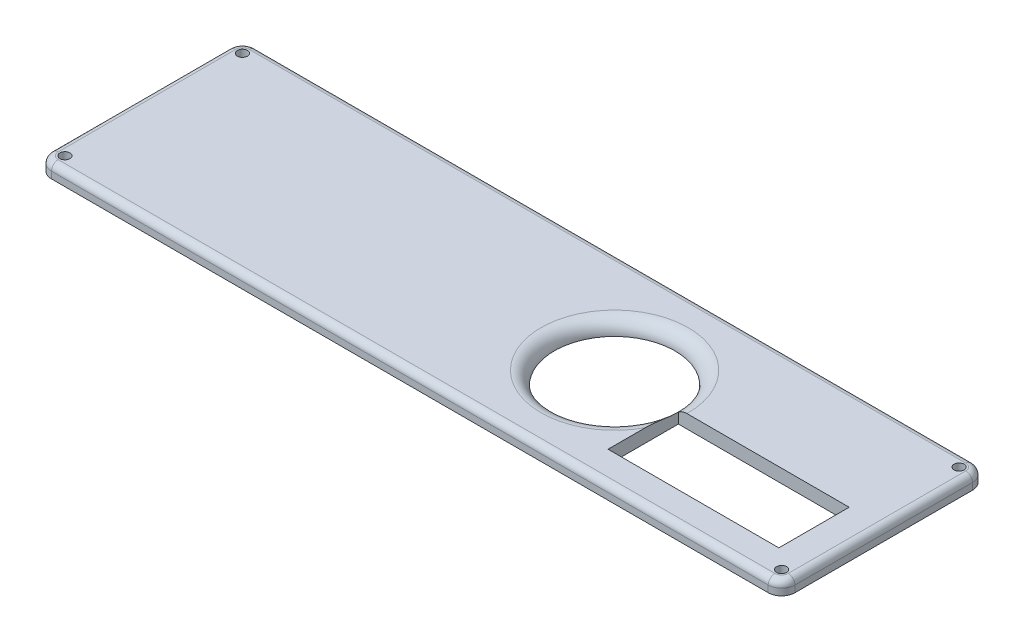
ISO-10303-21;
HEADER;
FILE_DESCRIPTION(('STEP AP214'),'2;1');
FILE_NAME('part.step','',(''),(''),'','','');
FILE_SCHEMA(('AUTOMOTIVE_DESIGN { 1 0 10303 214 1 1 1 1 }'));
ENDSEC;
DATA;
#1=APPLICATION_CONTEXT('core data for automotive mechanical design processes');
#2=APPLICATION_PROTOCOL_DEFINITION('international standard','automotive_design',2000,#1);
#3=PRODUCT_CONTEXT('',#1,'mechanical');
#4=PRODUCT('Part','Part','',(#3));
#5=PRODUCT_RELATED_PRODUCT_CATEGORY('part','',(#4));
#6=PRODUCT_DEFINITION_FORMATION('','',#4);
#7=PRODUCT_DEFINITION_CONTEXT('part definition',#1,'design');
#8=PRODUCT_DEFINITION('design','',#6,#7);
#9=PRODUCT_DEFINITION_SHAPE('','',#8);
#10=(LENGTH_UNIT() NAMED_UNIT(*) SI_UNIT(.MILLI.,.METRE.));
#11=(NAMED_UNIT(*) PLANE_ANGLE_UNIT() SI_UNIT($,.RADIAN.));
#12=(NAMED_UNIT(*) SI_UNIT($,.STERADIAN.) SOLID_ANGLE_UNIT());
#13=UNCERTAINTY_MEASURE_WITH_UNIT(LENGTH_MEASURE(1.E-05),#10,'distance_accuracy_value','');
#14=(GEOMETRIC_REPRESENTATION_CONTEXT(3) GLOBAL_UNCERTAINTY_ASSIGNED_CONTEXT((#13)) GLOBAL_UNIT_ASSIGNED_CONTEXT((#10,
#11,#12)) REPRESENTATION_CONTEXT('',''));
#15=CARTESIAN_POINT('',(0.,0.,0.));
#16=DIRECTION('',(0.,0.,1.));
#17=DIRECTION('',(1.,0.,0.));
#18=AXIS2_PLACEMENT_3D('',#15,#16,#17);
#19=CARTESIAN_POINT('',(0.,2.,0.));
#20=DIRECTION('',(0.,-1.,0.));
#21=DIRECTION('',(0.,0.,-1.));
#22=AXIS2_PLACEMENT_3D('',#19,#20,#21);
#23=PLANE('',#22);
#24=CARTESIAN_POINT('',(2.,2.,-2.));
#25=DIRECTION('',(0.,1.,0.));
#26=DIRECTION('',(0.,0.,1.));
#27=AXIS2_PLACEMENT_3D('',#24,#25,#26);
#28=CIRCLE('',#27,0.75);
#29=CARTESIAN_POINT('',(2.,2.,-1.25));
#30=VERTEX_POINT('',#29);
#31=EDGE_CURVE('E205',#30,#30,#28,.T.);
#32=ORIENTED_EDGE('',*,*,#31,.F.);
#33=EDGE_LOOP('',(#32));
#34=FACE_BOUND('',#33,.T.);
#35=CARTESIAN_POINT('',(109.,2.,-2.));
#36=DIRECTION('',(0.,1.,0.));
#37=DIRECTION('',(0.,0.,1.));
#38=AXIS2_PLACEMENT_3D('',#35,#36,#37);
#39=CIRCLE('',#38,0.749999999999999);
#40=CARTESIAN_POINT('',(109.,2.,-1.25));
#41=VERTEX_POINT('',#40);
#42=EDGE_CURVE('E211',#41,#41,#39,.T.);
#43=ORIENTED_EDGE('',*,*,#42,.F.);
#44=EDGE_LOOP('',(#43));
#45=FACE_BOUND('',#44,.T.);
#46=CARTESIAN_POINT('',(109.,2.,-28.5));
#47=DIRECTION('',(0.,1.,0.));
#48=DIRECTION('',(0.,0.,1.));
#49=AXIS2_PLACEMENT_3D('',#46,#47,#48);
#50=CIRCLE('',#49,0.749999999999999);
#51=CARTESIAN_POINT('',(109.,2.,-27.75));
#52=VERTEX_POINT('',#51);
#53=EDGE_CURVE('E217',#52,#52,#50,.T.);
#54=ORIENTED_EDGE('',*,*,#53,.F.);
#55=EDGE_LOOP('',(#54));
#56=FACE_BOUND('',#55,.T.);
#57=DIRECTION('',(0.,0.,1.));
#58=VECTOR('',#57,1.);
#59=CARTESIAN_POINT('',(80.49,2.,-4.6));
#60=LINE('',#59,#58);
#61=CARTESIAN_POINT('',(80.49,2.,-10.1790059442638));
#62=VERTEX_POINT('',#61);
#63=CARTESIAN_POINT('',(80.49,2.,-4.6));
#64=VERTEX_POINT('',#63);
#65=EDGE_CURVE('E164',#62,#64,#60,.T.);
#66=ORIENTED_EDGE('',*,*,#65,.F.);
#67=CARTESIAN_POINT('',(70.76,2.,-15.31));
#68=DIRECTION('',(0.,-1.,0.));
#69=DIRECTION('',(0.,0.,-1.));
#70=AXIS2_PLACEMENT_3D('',#67,#68,#69);
#71=CIRCLE('',#70,11.);
#72=CARTESIAN_POINT('',(81.7579952718666,2.,-15.1));
#73=VERTEX_POINT('',#72);
#74=EDGE_CURVE('E267',#62,#73,#71,.T.);
#75=ORIENTED_EDGE('',*,*,#74,.T.);
#76=DIRECTION('',(-1.,0.,0.));
#77=VECTOR('',#76,1.);
#78=CARTESIAN_POINT('',(80.49,2.,-15.1));
#79=LINE('',#78,#77);
#80=CARTESIAN_POINT('',(105.99,2.,-15.1));
#81=VERTEX_POINT('',#80);
#82=EDGE_CURVE('E182',#81,#73,#79,.T.);
#83=ORIENTED_EDGE('',*,*,#82,.F.);
#84=DIRECTION('',(0.,0.,-1.));
#85=VECTOR('',#84,1.);
#86=CARTESIAN_POINT('',(105.99,2.,-4.6));
#87=LINE('',#86,#85);
#88=CARTESIAN_POINT('',(105.99,2.,-4.6));
#89=VERTEX_POINT('',#88);
#90=EDGE_CURVE('E184',#89,#81,#87,.T.);
#91=ORIENTED_EDGE('',*,*,#90,.F.);
#92=DIRECTION('',(1.,0.,0.));
#93=VECTOR('',#92,1.);
#94=CARTESIAN_POINT('',(80.49,2.,-4.6));
#95=LINE('',#94,#93);
#96=EDGE_CURVE('E190',#64,#89,#95,.T.);
#97=ORIENTED_EDGE('',*,*,#96,.F.);
#98=EDGE_LOOP('',(#66,#75,#83,#91,#97));
#99=FACE_BOUND('',#98,.T.);
#100=CARTESIAN_POINT('',(2.,2.,-28.5));
#101=DIRECTION('',(0.,1.,0.));
#102=DIRECTION('',(0.,0.,1.));
#103=AXIS2_PLACEMENT_3D('',#100,#101,#102);
#104=CIRCLE('',#103,0.75);
#105=CARTESIAN_POINT('',(2.,2.,-27.75));
#106=VERTEX_POINT('',#105);
#107=EDGE_CURVE('E204',#106,#106,#104,.T.);
#108=ORIENTED_EDGE('',*,*,#107,.F.);
#109=EDGE_LOOP('',(#108));
#110=FACE_BOUND('',#109,.T.);
#111=CARTESIAN_POINT('',(109.,2.,-2.));
#112=DIRECTION('',(0.,-1.,0.));
#113=DIRECTION('',(0.,0.,-1.));
#114=AXIS2_PLACEMENT_3D('',#111,#112,#113);
#115=CIRCLE('',#114,1.);
#116=CARTESIAN_POINT('',(110.,2.,-2.));
#117=VERTEX_POINT('',#116);
#118=CARTESIAN_POINT('',(109.,2.,-1.));
#119=VERTEX_POINT('',#118);
#120=EDGE_CURVE('E278',#117,#119,#115,.T.);
#121=ORIENTED_EDGE('',*,*,#120,.F.);
#122=DIRECTION('',(0.,0.,-1.));
#123=VECTOR('',#122,1.);
#124=CARTESIAN_POINT('',(110.,2.,0.));
#125=LINE('',#124,#123);
#126=CARTESIAN_POINT('',(110.,2.,-28.5));
#127=VERTEX_POINT('',#126);
#128=EDGE_CURVE('E244',#117,#127,#125,.T.);
#129=ORIENTED_EDGE('',*,*,#128,.T.);
#130=CARTESIAN_POINT('',(109.,2.,-28.5));
#131=DIRECTION('',(0.,-1.,0.));
#132=DIRECTION('',(0.,0.,-1.));
#133=AXIS2_PLACEMENT_3D('',#130,#131,#132);
#134=CIRCLE('',#133,1.);
#135=CARTESIAN_POINT('',(109.,2.,-29.5));
#136=VERTEX_POINT('',#135);
#137=EDGE_CURVE('E276',#136,#127,#134,.T.);
#138=ORIENTED_EDGE('',*,*,#137,.F.);
#139=DIRECTION('',(-1.,0.,0.));
#140=VECTOR('',#139,1.);
#141=CARTESIAN_POINT('',(0.,2.,-29.5));
#142=LINE('',#141,#140);
#143=CARTESIAN_POINT('',(2.,2.,-29.5));
#144=VERTEX_POINT('',#143);
#145=EDGE_CURVE('E247',#136,#144,#142,.T.);
#146=ORIENTED_EDGE('',*,*,#145,.T.);
#147=CARTESIAN_POINT('',(2.,2.,-28.5));
#148=DIRECTION('',(0.,-1.,0.));
#149=DIRECTION('',(0.,0.,-1.));
#150=AXIS2_PLACEMENT_3D('',#147,#148,#149);
#151=CIRCLE('',#150,1.);
#152=CARTESIAN_POINT('',(1.,2.,-28.5));
#153=VERTEX_POINT('',#152);
#154=EDGE_CURVE('E273',#153,#144,#151,.T.);
#155=ORIENTED_EDGE('',*,*,#154,.F.);
#156=DIRECTION('',(0.,0.,1.));
#157=VECTOR('',#156,1.);
#158=CARTESIAN_POINT('',(1.,2.,0.));
#159=LINE('',#158,#157);
#160=CARTESIAN_POINT('',(1.,2.,-2.));
#161=VERTEX_POINT('',#160);
#162=EDGE_CURVE('E238',#153,#161,#159,.T.);
#163=ORIENTED_EDGE('',*,*,#162,.T.);
#164=CARTESIAN_POINT('',(2.,2.,-2.));
#165=DIRECTION('',(0.,-1.,0.));
#166=DIRECTION('',(0.,0.,-1.));
#167=AXIS2_PLACEMENT_3D('',#164,#165,#166);
#168=CIRCLE('',#167,1.);
#169=CARTESIAN_POINT('',(2.,2.,-1.));
#170=VERTEX_POINT('',#169);
#171=EDGE_CURVE('E270',#170,#161,#168,.T.);
#172=ORIENTED_EDGE('',*,*,#171,.F.);
#173=DIRECTION('',(1.,0.,0.));
#174=VECTOR('',#173,1.);
#175=CARTESIAN_POINT('',(0.,2.,-1.));
#176=LINE('',#175,#174);
#177=EDGE_CURVE('E241',#170,#119,#176,.T.);
#178=ORIENTED_EDGE('',*,*,#177,.T.);
#179=EDGE_LOOP('',(#121,#129,#138,#146,#155,#163,#172,#178));
#180=FACE_BOUND('',#179,.T.);
#181=ADVANCED_FACE('F35',(#34,#45,#56,#99,#110,#180),#23,.F.);
#182=CARTESIAN_POINT('',(0.,2.,0.));
#183=DIRECTION('',(1.,0.,0.));
#184=DIRECTION('',(0.,0.,-1.));
#185=AXIS2_PLACEMENT_3D('',#182,#183,#184);
#186=PLANE('',#185);
#187=DIRECTION('',(0.,0.,1.));
#188=VECTOR('',#187,1.);
#189=CARTESIAN_POINT('',(0.,0.,0.));
#190=LINE('',#189,#188);
#191=CARTESIAN_POINT('',(0.,0.,-28.5));
#192=VERTEX_POINT('',#191);
#193=CARTESIAN_POINT('',(0.,0.,-2.));
#194=VERTEX_POINT('',#193);
#195=EDGE_CURVE('E225',#192,#194,#190,.T.);
#196=ORIENTED_EDGE('',*,*,#195,.T.);
#197=DIRECTION('',(0.,-1.,0.));
#198=VECTOR('',#197,1.);
#199=CARTESIAN_POINT('',(0.,2.,-2.));
#200=LINE('',#199,#198);
#201=CARTESIAN_POINT('',(0.,1.,-2.));
#202=VERTEX_POINT('',#201);
#203=EDGE_CURVE('E306',#194,#202,#200,.F.);
#204=ORIENTED_EDGE('',*,*,#203,.T.);
#205=DIRECTION('',(0.,0.,1.));
#206=VECTOR('',#205,1.);
#207=CARTESIAN_POINT('',(0.,1.,0.));
#208=LINE('',#207,#206);
#209=CARTESIAN_POINT('',(0.,1.,-28.5));
#210=VERTEX_POINT('',#209);
#211=EDGE_CURVE('E259',#202,#210,#208,.F.);
#212=ORIENTED_EDGE('',*,*,#211,.T.);
#213=DIRECTION('',(0.,-1.,0.));
#214=VECTOR('',#213,1.);
#215=CARTESIAN_POINT('',(0.,2.,-28.5));
#216=LINE('',#215,#214);
#217=EDGE_CURVE('E304',#210,#192,#216,.T.);
#218=ORIENTED_EDGE('',*,*,#217,.T.);
#219=EDGE_LOOP('',(#196,#204,#212,#218));
#220=FACE_BOUND('',#219,.T.);
#221=ADVANCED_FACE('F356',(#220),#186,.F.);
#222=CARTESIAN_POINT('',(0.,2.,0.));
#223=DIRECTION('',(0.,0.,-1.));
#224=DIRECTION('',(-1.,0.,0.));
#225=AXIS2_PLACEMENT_3D('',#222,#223,#224);
#226=PLANE('',#225);
#227=DIRECTION('',(1.,0.,0.));
#228=VECTOR('',#227,1.);
#229=CARTESIAN_POINT('',(0.,1.,0.));
#230=LINE('',#229,#228);
#231=CARTESIAN_POINT('',(109.,1.,0.));
#232=VERTEX_POINT('',#231);
#233=CARTESIAN_POINT('',(2.,1.,0.));
#234=VERTEX_POINT('',#233);
#235=EDGE_CURVE('E256',#232,#234,#230,.F.);
#236=ORIENTED_EDGE('',*,*,#235,.T.);
#237=DIRECTION('',(0.,-1.,0.));
#238=VECTOR('',#237,1.);
#239=CARTESIAN_POINT('',(2.,2.,0.));
#240=LINE('',#239,#238);
#241=CARTESIAN_POINT('',(2.,0.,0.));
#242=VERTEX_POINT('',#241);
#243=EDGE_CURVE('E295',#234,#242,#240,.T.);
#244=ORIENTED_EDGE('',*,*,#243,.T.);
#245=DIRECTION('',(1.,0.,0.));
#246=VECTOR('',#245,1.);
#247=CARTESIAN_POINT('',(0.,0.,0.));
#248=LINE('',#247,#246);
#249=CARTESIAN_POINT('',(109.,0.,0.));
#250=VERTEX_POINT('',#249);
#251=EDGE_CURVE('E230',#242,#250,#248,.T.);
#252=ORIENTED_EDGE('',*,*,#251,.T.);
#253=DIRECTION('',(0.,-1.,0.));
#254=VECTOR('',#253,1.);
#255=CARTESIAN_POINT('',(109.,2.,0.));
#256=LINE('',#255,#254);
#257=EDGE_CURVE('E293',#250,#232,#256,.F.);
#258=ORIENTED_EDGE('',*,*,#257,.T.);
#259=EDGE_LOOP('',(#236,#244,#252,#258));
#260=FACE_BOUND('',#259,.T.);
#261=ADVANCED_FACE('F368',(#260),#226,.F.);
#262=CARTESIAN_POINT('',(111.,2.,0.));
#263=DIRECTION('',(-1.,0.,0.));
#264=DIRECTION('',(0.,0.,1.));
#265=AXIS2_PLACEMENT_3D('',#262,#263,#264);
#266=PLANE('',#265);
#267=DIRECTION('',(0.,0.,-1.));
#268=VECTOR('',#267,1.);
#269=CARTESIAN_POINT('',(111.,0.,0.));
#270=LINE('',#269,#268);
#271=CARTESIAN_POINT('',(111.,0.,-2.));
#272=VERTEX_POINT('',#271);
#273=CARTESIAN_POINT('',(111.,0.,-28.5));
#274=VERTEX_POINT('',#273);
#275=EDGE_CURVE('E233',#272,#274,#270,.T.);
#276=ORIENTED_EDGE('',*,*,#275,.T.);
#277=DIRECTION('',(0.,-1.,0.));
#278=VECTOR('',#277,1.);
#279=CARTESIAN_POINT('',(111.,2.,-28.5));
#280=LINE('',#279,#278);
#281=CARTESIAN_POINT('',(111.,1.,-28.5));
#282=VERTEX_POINT('',#281);
#283=EDGE_CURVE('E314',#274,#282,#280,.F.);
#284=ORIENTED_EDGE('',*,*,#283,.T.);
#285=DIRECTION('',(0.,0.,-1.));
#286=VECTOR('',#285,1.);
#287=CARTESIAN_POINT('',(111.,1.,0.));
#288=LINE('',#287,#286);
#289=CARTESIAN_POINT('',(111.,1.,-2.));
#290=VERTEX_POINT('',#289);
#291=EDGE_CURVE('E253',#282,#290,#288,.F.);
#292=ORIENTED_EDGE('',*,*,#291,.T.);
#293=DIRECTION('',(0.,-1.,0.));
#294=VECTOR('',#293,1.);
#295=CARTESIAN_POINT('',(111.,2.,-2.));
#296=LINE('',#295,#294);
#297=EDGE_CURVE('E312',#290,#272,#296,.T.);
#298=ORIENTED_EDGE('',*,*,#297,.T.);
#299=EDGE_LOOP('',(#276,#284,#292,#298));
#300=FACE_BOUND('',#299,.T.);
#301=ADVANCED_FACE('F364',(#300),#266,.F.);
#302=CARTESIAN_POINT('',(0.,2.,-30.5));
#303=DIRECTION('',(0.,0.,1.));
#304=DIRECTION('',(1.,0.,0.));
#305=AXIS2_PLACEMENT_3D('',#302,#303,#304);
#306=PLANE('',#305);
#307=DIRECTION('',(-1.,0.,0.));
#308=VECTOR('',#307,1.);
#309=CARTESIAN_POINT('',(0.,0.,-30.5));
#310=LINE('',#309,#308);
#311=CARTESIAN_POINT('',(109.,0.,-30.5));
#312=VERTEX_POINT('',#311);
#313=CARTESIAN_POINT('',(2.,0.,-30.5));
#314=VERTEX_POINT('',#313);
#315=EDGE_CURVE('E235',#312,#314,#310,.T.);
#316=ORIENTED_EDGE('',*,*,#315,.T.);
#317=DIRECTION('',(0.,-1.,0.));
#318=VECTOR('',#317,1.);
#319=CARTESIAN_POINT('',(2.,2.,-30.5));
#320=LINE('',#319,#318);
#321=CARTESIAN_POINT('',(2.,1.,-30.5));
#322=VERTEX_POINT('',#321);
#323=EDGE_CURVE('E310',#314,#322,#320,.F.);
#324=ORIENTED_EDGE('',*,*,#323,.T.);
#325=DIRECTION('',(-1.,0.,0.));
#326=VECTOR('',#325,1.);
#327=CARTESIAN_POINT('',(0.,1.,-30.5));
#328=LINE('',#327,#326);
#329=CARTESIAN_POINT('',(109.,1.,-30.5));
#330=VERTEX_POINT('',#329);
#331=EDGE_CURVE('E250',#322,#330,#328,.F.);
#332=ORIENTED_EDGE('',*,*,#331,.T.);
#333=DIRECTION('',(0.,-1.,0.));
#334=VECTOR('',#333,1.);
#335=CARTESIAN_POINT('',(109.,2.,-30.5));
#336=LINE('',#335,#334);
#337=EDGE_CURVE('E308',#330,#312,#336,.T.);
#338=ORIENTED_EDGE('',*,*,#337,.T.);
#339=EDGE_LOOP('',(#316,#324,#332,#338));
#340=FACE_BOUND('',#339,.T.);
#341=ADVANCED_FACE('F360',(#340),#306,.F.);
#342=CARTESIAN_POINT('',(0.,0.,0.));
#343=DIRECTION('',(0.,-1.,0.));
#344=DIRECTION('',(0.,0.,-1.));
#345=AXIS2_PLACEMENT_3D('',#342,#343,#344);
#346=PLANE('',#345);
#347=CARTESIAN_POINT('',(2.,0.,-2.));
#348=DIRECTION('',(0.,1.,0.));
#349=DIRECTION('',(0.,0.,1.));
#350=AXIS2_PLACEMENT_3D('',#347,#348,#349);
#351=CIRCLE('',#350,0.75);
#352=CARTESIAN_POINT('',(2.,0.,-1.25));
#353=VERTEX_POINT('',#352);
#354=EDGE_CURVE('E201',#353,#353,#351,.T.);
#355=ORIENTED_EDGE('',*,*,#354,.T.);
#356=EDGE_LOOP('',(#355));
#357=FACE_BOUND('',#356,.T.);
#358=CARTESIAN_POINT('',(109.,0.,-2.));
#359=DIRECTION('',(0.,1.,0.));
#360=DIRECTION('',(0.,0.,1.));
#361=AXIS2_PLACEMENT_3D('',#358,#359,#360);
#362=CIRCLE('',#361,0.749999999999999);
#363=CARTESIAN_POINT('',(109.,0.,-1.25));
#364=VERTEX_POINT('',#363);
#365=EDGE_CURVE('E208',#364,#364,#362,.T.);
#366=ORIENTED_EDGE('',*,*,#365,.T.);
#367=EDGE_LOOP('',(#366));
#368=FACE_BOUND('',#367,.T.);
#369=CARTESIAN_POINT('',(109.,0.,-28.5));
#370=DIRECTION('',(0.,1.,0.));
#371=DIRECTION('',(0.,0.,1.));
#372=AXIS2_PLACEMENT_3D('',#369,#370,#371);
#373=CIRCLE('',#372,0.749999999999999);
#374=CARTESIAN_POINT('',(109.,0.,-27.75));
#375=VERTEX_POINT('',#374);
#376=EDGE_CURVE('E214',#375,#375,#373,.T.);
#377=ORIENTED_EDGE('',*,*,#376,.T.);
#378=EDGE_LOOP('',(#377));
#379=FACE_BOUND('',#378,.T.);
#380=CARTESIAN_POINT('',(70.76,0.,-15.31));
#381=DIRECTION('',(0.,1.,0.));
#382=DIRECTION('',(0.,0.,1.));
#383=AXIS2_PLACEMENT_3D('',#380,#381,#382);
#384=CIRCLE('',#383,9.);
#385=CARTESIAN_POINT('',(70.76,0.,-6.31));
#386=VERTEX_POINT('',#385);
#387=EDGE_CURVE('E197',#386,#386,#384,.T.);
#388=ORIENTED_EDGE('',*,*,#387,.T.);
#389=EDGE_LOOP('',(#388));
#390=FACE_BOUND('',#389,.T.);
#391=DIRECTION('',(0.,0.,1.));
#392=VECTOR('',#391,1.);
#393=CARTESIAN_POINT('',(80.49,0.,-4.6));
#394=LINE('',#393,#392);
#395=CARTESIAN_POINT('',(80.49,0.,-15.1));
#396=VERTEX_POINT('',#395);
#397=CARTESIAN_POINT('',(80.49,0.,-4.6));
#398=VERTEX_POINT('',#397);
#399=EDGE_CURVE('E161',#396,#398,#394,.T.);
#400=ORIENTED_EDGE('',*,*,#399,.T.);
#401=DIRECTION('',(1.,0.,0.));
#402=VECTOR('',#401,1.);
#403=CARTESIAN_POINT('',(80.49,0.,-4.6));
#404=LINE('',#403,#402);
#405=CARTESIAN_POINT('',(105.99,0.,-4.6));
#406=VERTEX_POINT('',#405);
#407=EDGE_CURVE('E173',#398,#406,#404,.T.);
#408=ORIENTED_EDGE('',*,*,#407,.T.);
#409=DIRECTION('',(0.,0.,-1.));
#410=VECTOR('',#409,1.);
#411=CARTESIAN_POINT('',(105.99,0.,-4.6));
#412=LINE('',#411,#410);
#413=CARTESIAN_POINT('',(105.99,0.,-15.1));
#414=VERTEX_POINT('',#413);
#415=EDGE_CURVE('E177',#406,#414,#412,.T.);
#416=ORIENTED_EDGE('',*,*,#415,.T.);
#417=DIRECTION('',(-1.,0.,0.));
#418=VECTOR('',#417,1.);
#419=CARTESIAN_POINT('',(80.49,0.,-15.1));
#420=LINE('',#419,#418);
#421=EDGE_CURVE('E169',#414,#396,#420,.T.);
#422=ORIENTED_EDGE('',*,*,#421,.T.);
#423=EDGE_LOOP('',(#400,#408,#416,#422));
#424=FACE_BOUND('',#423,.T.);
#425=CARTESIAN_POINT('',(2.,0.,-28.5));
#426=DIRECTION('',(0.,1.,0.));
#427=DIRECTION('',(0.,0.,1.));
#428=AXIS2_PLACEMENT_3D('',#425,#426,#427);
#429=CIRCLE('',#428,0.75);
#430=CARTESIAN_POINT('',(2.,0.,-27.75));
#431=VERTEX_POINT('',#430);
#432=EDGE_CURVE('E222',#431,#431,#429,.T.);
#433=ORIENTED_EDGE('',*,*,#432,.T.);
#434=EDGE_LOOP('',(#433));
#435=FACE_BOUND('',#434,.T.);
#436=ORIENTED_EDGE('',*,*,#251,.F.);
#437=CARTESIAN_POINT('',(2.,0.,-2.));
#438=DIRECTION('',(0.,-1.,0.));
#439=DIRECTION('',(0.,0.,-1.));
#440=AXIS2_PLACEMENT_3D('',#437,#438,#439);
#441=CIRCLE('',#440,2.);
#442=EDGE_CURVE('E302',#242,#194,#441,.T.);
#443=ORIENTED_EDGE('',*,*,#442,.T.);
#444=ORIENTED_EDGE('',*,*,#195,.F.);
#445=CARTESIAN_POINT('',(2.,0.,-28.5));
#446=DIRECTION('',(0.,-1.,0.));
#447=DIRECTION('',(0.,0.,-1.));
#448=AXIS2_PLACEMENT_3D('',#445,#446,#447);
#449=CIRCLE('',#448,2.);
#450=EDGE_CURVE('E300',#192,#314,#449,.T.);
#451=ORIENTED_EDGE('',*,*,#450,.T.);
#452=ORIENTED_EDGE('',*,*,#315,.F.);
#453=CARTESIAN_POINT('',(109.,0.,-28.5));
#454=DIRECTION('',(0.,-1.,0.));
#455=DIRECTION('',(0.,0.,-1.));
#456=AXIS2_PLACEMENT_3D('',#453,#454,#455);
#457=CIRCLE('',#456,2.);
#458=EDGE_CURVE('E60',#312,#274,#457,.T.);
#459=ORIENTED_EDGE('',*,*,#458,.T.);
#460=ORIENTED_EDGE('',*,*,#275,.F.);
#461=CARTESIAN_POINT('',(109.,0.,-2.));
#462=DIRECTION('',(0.,-1.,0.));
#463=DIRECTION('',(0.,0.,-1.));
#464=AXIS2_PLACEMENT_3D('',#461,#462,#463);
#465=CIRCLE('',#464,2.);
#466=EDGE_CURVE('E297',#272,#250,#465,.T.);
#467=ORIENTED_EDGE('',*,*,#466,.T.);
#468=EDGE_LOOP('',(#436,#443,#444,#451,#452,#459,#460,#467));
#469=FACE_BOUND('',#468,.T.);
#470=ADVANCED_FACE('F179',(#357,#368,#379,#390,#424,#435,#469),#346,.T.);
#471=CARTESIAN_POINT('',(2.,0.,-28.5));
#472=DIRECTION('',(0.,1.,0.));
#473=DIRECTION('',(0.,0.,1.));
#474=AXIS2_PLACEMENT_3D('',#471,#472,#473);
#475=CYLINDRICAL_SURFACE('',#474,0.75);
#476=ORIENTED_EDGE('',*,*,#432,.F.);
#477=EDGE_LOOP('',(#476));
#478=FACE_BOUND('',#477,.T.);
#479=ORIENTED_EDGE('',*,*,#107,.T.);
#480=EDGE_LOOP('',(#479));
#481=FACE_BOUND('',#480,.T.);
#482=ADVANCED_FACE('F338',(#478,#481),#475,.F.);
#483=CARTESIAN_POINT('',(80.49,0.,-4.6));
#484=DIRECTION('',(-1.,0.,0.));
#485=DIRECTION('',(0.,0.,1.));
#486=AXIS2_PLACEMENT_3D('',#483,#484,#485);
#487=PLANE('',#486);
#488=DIRECTION('',(0.,1.,0.));
#489=VECTOR('',#488,1.);
#490=CARTESIAN_POINT('',(80.49,0.,-15.1));
#491=LINE('',#490,#489);
#492=CARTESIAN_POINT('',(80.49,1.54688406499508,-15.1));
#493=VERTEX_POINT('',#492);
#494=EDGE_CURVE('E195',#396,#493,#491,.T.);
#495=ORIENTED_EDGE('',*,*,#494,.T.);
#496=CARTESIAN_POINT('',(80.49,1.54688406499508,-15.1));
#497=CARTESIAN_POINT('',(80.49,1.54836101973832,-15.0160983410754));
#498=CARTESIAN_POINT('',(80.49,1.55073523962752,-14.9322157803039));
#499=CARTESIAN_POINT('',(80.49,1.5571770135873,-14.7645230289502));
#500=CARTESIAN_POINT('',(80.49,1.56124441320873,-14.6807128324657));
#501=CARTESIAN_POINT('',(80.49,1.57582763456818,-14.429550738422));
#502=CARTESIAN_POINT('',(80.49,1.58872711915541,-14.2623354007042));
#503=CARTESIAN_POINT('',(80.49,1.61951430992723,-13.9285039494403));
#504=CARTESIAN_POINT('',(80.49,1.63739850063391,-13.7618874971057));
#505=CARTESIAN_POINT('',(80.49,1.67644702317066,-13.4290167656739));
#506=CARTESIAN_POINT('',(80.49,1.6976120157782,-13.2627625663924));
#507=CARTESIAN_POINT('',(80.49,1.74133215704153,-12.9309448355905));
#508=CARTESIAN_POINT('',(80.49,1.76388296750052,-12.7653807237884));
#509=CARTESIAN_POINT('',(80.49,1.80863446404954,-12.4342192194358));
#510=CARTESIAN_POINT('',(80.49,1.83083515999043,-12.268621827955));
#511=CARTESIAN_POINT('',(80.49,1.89427906155808,-11.7715390303051));
#512=CARTESIAN_POINT('',(80.49,1.9323916231249,-11.4395834864884));
#513=CARTESIAN_POINT('',(80.49,1.97192585053372,-10.952407888564));
#514=CARTESIAN_POINT('',(80.49,1.98206160288305,-10.7979404115097));
#515=CARTESIAN_POINT('',(80.49,1.99608897585564,-10.488673225415));
#516=CARTESIAN_POINT('',(80.49,1.99997821873826,-10.3338734123112));
#517=CARTESIAN_POINT('',(80.49,2.,-10.1790059442638));
#518=B_SPLINE_CURVE_WITH_KNOTS('',3,(#496,#497,#498,#499,#500,#501,#502,#503,#504,#505,#506,
#507,#508,#509,#510,#511,#512,#513,#514,#515,#516,#517),.UNSPECIFIED.,.F.,.F.,(4,2,2,2,2,2,2,2,
2,2,4),(0.,0.251733781793701,0.503444605860818,1.00647065174504,1.50914283087387,
2.01191638371273,2.51318915877824,3.01444780470986,4.01642016263951,4.48070229862639,
4.94516112226549),.UNSPECIFIED.);
#519=EDGE_CURVE('E11',#493,#62,#518,.T.);
#520=ORIENTED_EDGE('',*,*,#519,.T.);
#521=ORIENTED_EDGE('',*,*,#65,.T.);
#522=DIRECTION('',(0.,1.,0.));
#523=VECTOR('',#522,1.);
#524=CARTESIAN_POINT('',(80.49,0.,-4.6));
#525=LINE('',#524,#523);
#526=EDGE_CURVE('E157',#398,#64,#525,.T.);
#527=ORIENTED_EDGE('',*,*,#526,.F.);
#528=ORIENTED_EDGE('',*,*,#399,.F.);
#529=EDGE_LOOP('',(#495,#520,#521,#527,#528));
#530=FACE_BOUND('',#529,.T.);
#531=ADVANCED_FACE('F159',(#530),#487,.F.);
#532=CARTESIAN_POINT('',(80.49,0.,-15.1));
#533=DIRECTION('',(0.,0.,-1.));
#534=DIRECTION('',(-1.,0.,0.));
#535=AXIS2_PLACEMENT_3D('',#532,#533,#534);
#536=PLANE('',#535);
#537=ORIENTED_EDGE('',*,*,#82,.T.);
#538=CARTESIAN_POINT('',(81.7579952718666,2.,-15.1));
#539=CARTESIAN_POINT('',(81.7009250164018,2.00000128168164,-15.1));
#540=CARTESIAN_POINT('',(81.6438786864028,1.99755715785855,-15.1));
#541=CARTESIAN_POINT('',(81.530208702813,1.98780926320806,-15.1));
#542=CARTESIAN_POINT('',(81.4735850061573,1.98050599453932,-15.1));
#543=CARTESIAN_POINT('',(81.3081439209353,1.95191538120008,-15.1));
#544=CARTESIAN_POINT('',(81.2004153264184,1.92393565600092,-15.1));
#545=CARTESIAN_POINT('',(80.9875079894138,1.84925072705947,-15.1));
#546=CARTESIAN_POINT('',(80.8825406063595,1.80194097983324,-15.1));
#547=CARTESIAN_POINT('',(80.7309036549253,1.7172669428081,-15.1));
#548=CARTESIAN_POINT('',(80.6806320419295,1.68619220731186,-15.1));
#549=CARTESIAN_POINT('',(80.5830272858405,1.61972125886649,-15.1));
#550=CARTESIAN_POINT('',(80.5356943281493,1.5843247736719,-15.1));
#551=CARTESIAN_POINT('',(80.49,1.54688406499509,-15.1));
#552=B_SPLINE_CURVE_WITH_KNOTS('',3,(#538,#539,#540,#541,#542,#543,#544,#545,#546,#547,#548,
#549,#550,#551),.UNSPECIFIED.,.F.,.F.,(4,2,2,2,2,2,4),(0.,0.171111030763403,0.342204381143879,
0.674497248555664,1.01809245417365,1.19519064517904,1.37229999811684),.UNSPECIFIED.);
#553=EDGE_CURVE('E45',#73,#493,#552,.T.);
#554=ORIENTED_EDGE('',*,*,#553,.T.);
#555=ORIENTED_EDGE('',*,*,#494,.F.);
#556=ORIENTED_EDGE('',*,*,#421,.F.);
#557=DIRECTION('',(0.,1.,0.));
#558=VECTOR('',#557,1.);
#559=CARTESIAN_POINT('',(105.99,0.,-15.1));
#560=LINE('',#559,#558);
#561=EDGE_CURVE('E198',#414,#81,#560,.T.);
#562=ORIENTED_EDGE('',*,*,#561,.T.);
#563=EDGE_LOOP('',(#537,#554,#555,#556,#562));
#564=FACE_BOUND('',#563,.T.);
#565=ADVANCED_FACE('F325',(#564),#536,.F.);
#566=CARTESIAN_POINT('',(105.99,0.,-4.6));
#567=DIRECTION('',(1.,0.,0.));
#568=DIRECTION('',(0.,0.,-1.));
#569=AXIS2_PLACEMENT_3D('',#566,#567,#568);
#570=PLANE('',#569);
#571=ORIENTED_EDGE('',*,*,#90,.T.);
#572=ORIENTED_EDGE('',*,*,#561,.F.);
#573=ORIENTED_EDGE('',*,*,#415,.F.);
#574=DIRECTION('',(0.,1.,0.));
#575=VECTOR('',#574,1.);
#576=CARTESIAN_POINT('',(105.99,0.,-4.6));
#577=LINE('',#576,#575);
#578=EDGE_CURVE('E168',#406,#89,#577,.T.);
#579=ORIENTED_EDGE('',*,*,#578,.T.);
#580=EDGE_LOOP('',(#571,#572,#573,#579));
#581=FACE_BOUND('',#580,.T.);
#582=ADVANCED_FACE('F329',(#581),#570,.F.);
#583=CARTESIAN_POINT('',(80.49,0.,-4.6));
#584=DIRECTION('',(0.,0.,1.));
#585=DIRECTION('',(1.,0.,0.));
#586=AXIS2_PLACEMENT_3D('',#583,#584,#585);
#587=PLANE('',#586);
#588=ORIENTED_EDGE('',*,*,#96,.T.);
#589=ORIENTED_EDGE('',*,*,#578,.F.);
#590=ORIENTED_EDGE('',*,*,#407,.F.);
#591=ORIENTED_EDGE('',*,*,#526,.T.);
#592=EDGE_LOOP('',(#588,#589,#590,#591));
#593=FACE_BOUND('',#592,.T.);
#594=ADVANCED_FACE('F174',(#593),#587,.F.);
#595=CARTESIAN_POINT('',(109.,0.,-28.5));
#596=DIRECTION('',(0.,1.,0.));
#597=DIRECTION('',(0.,0.,1.));
#598=AXIS2_PLACEMENT_3D('',#595,#596,#597);
#599=CYLINDRICAL_SURFACE('',#598,0.749999999999999);
#600=ORIENTED_EDGE('',*,*,#376,.F.);
#601=EDGE_LOOP('',(#600));
#602=FACE_BOUND('',#601,.T.);
#603=ORIENTED_EDGE('',*,*,#53,.T.);
#604=EDGE_LOOP('',(#603));
#605=FACE_BOUND('',#604,.T.);
#606=ADVANCED_FACE('F334',(#602,#605),#599,.F.);
#607=CARTESIAN_POINT('',(109.,0.,-2.));
#608=DIRECTION('',(0.,1.,0.));
#609=DIRECTION('',(0.,0.,1.));
#610=AXIS2_PLACEMENT_3D('',#607,#608,#609);
#611=CYLINDRICAL_SURFACE('',#610,0.749999999999999);
#612=ORIENTED_EDGE('',*,*,#365,.F.);
#613=EDGE_LOOP('',(#612));
#614=FACE_BOUND('',#613,.T.);
#615=ORIENTED_EDGE('',*,*,#42,.T.);
#616=EDGE_LOOP('',(#615));
#617=FACE_BOUND('',#616,.T.);
#618=ADVANCED_FACE('F343',(#614,#617),#611,.F.);
#619=CARTESIAN_POINT('',(2.,0.,-2.));
#620=DIRECTION('',(0.,1.,0.));
#621=DIRECTION('',(0.,0.,1.));
#622=AXIS2_PLACEMENT_3D('',#619,#620,#621);
#623=CYLINDRICAL_SURFACE('',#622,0.75);
#624=ORIENTED_EDGE('',*,*,#354,.F.);
#625=EDGE_LOOP('',(#624));
#626=FACE_BOUND('',#625,.T.);
#627=ORIENTED_EDGE('',*,*,#31,.T.);
#628=EDGE_LOOP('',(#627));
#629=FACE_BOUND('',#628,.T.);
#630=ADVANCED_FACE('F339',(#626,#629),#623,.F.);
#631=CARTESIAN_POINT('',(0.,1.,-1.));
#632=DIRECTION('',(1.,0.,0.));
#633=DIRECTION('',(0.,0.,-1.));
#634=AXIS2_PLACEMENT_3D('',#631,#632,#633);
#635=CYLINDRICAL_SURFACE('',#634,1.);
#636=ORIENTED_EDGE('',*,*,#235,.F.);
#637=CARTESIAN_POINT('',(109.,1.,-1.));
#638=DIRECTION('',(-1.,0.,0.));
#639=DIRECTION('',(0.,0.,1.));
#640=AXIS2_PLACEMENT_3D('',#637,#638,#639);
#641=CIRCLE('',#640,1.);
#642=EDGE_CURVE('E264',#232,#119,#641,.T.);
#643=ORIENTED_EDGE('',*,*,#642,.T.);
#644=ORIENTED_EDGE('',*,*,#177,.F.);
#645=CARTESIAN_POINT('',(2.,1.,-1.));
#646=DIRECTION('',(1.,0.,0.));
#647=DIRECTION('',(0.,0.,-1.));
#648=AXIS2_PLACEMENT_3D('',#645,#646,#647);
#649=CIRCLE('',#648,1.);
#650=EDGE_CURVE('E262',#170,#234,#649,.T.);
#651=ORIENTED_EDGE('',*,*,#650,.T.);
#652=EDGE_LOOP('',(#636,#643,#644,#651));
#653=FACE_BOUND('',#652,.T.);
#654=ADVANCED_FACE('F342',(#653),#635,.T.);
#655=CARTESIAN_POINT('',(110.,1.,0.));
#656=DIRECTION('',(0.,0.,-1.));
#657=DIRECTION('',(-1.,0.,0.));
#658=AXIS2_PLACEMENT_3D('',#655,#656,#657);
#659=CYLINDRICAL_SURFACE('',#658,1.);
#660=ORIENTED_EDGE('',*,*,#291,.F.);
#661=CARTESIAN_POINT('',(110.,1.,-28.5));
#662=DIRECTION('',(0.,0.,1.));
#663=DIRECTION('',(1.,0.,0.));
#664=AXIS2_PLACEMENT_3D('',#661,#662,#663);
#665=CIRCLE('',#664,1.);
#666=EDGE_CURVE('E282',#282,#127,#665,.T.);
#667=ORIENTED_EDGE('',*,*,#666,.T.);
#668=ORIENTED_EDGE('',*,*,#128,.F.);
#669=CARTESIAN_POINT('',(110.,1.,-2.));
#670=DIRECTION('',(0.,0.,-1.));
#671=DIRECTION('',(-1.,0.,0.));
#672=AXIS2_PLACEMENT_3D('',#669,#670,#671);
#673=CIRCLE('',#672,1.);
#674=EDGE_CURVE('E280',#117,#290,#673,.T.);
#675=ORIENTED_EDGE('',*,*,#674,.T.);
#676=EDGE_LOOP('',(#660,#667,#668,#675));
#677=FACE_BOUND('',#676,.T.);
#678=ADVANCED_FACE('F384',(#677),#659,.T.);
#679=CARTESIAN_POINT('',(1.,1.,0.));
#680=DIRECTION('',(0.,0.,1.));
#681=DIRECTION('',(1.,0.,0.));
#682=AXIS2_PLACEMENT_3D('',#679,#680,#681);
#683=CYLINDRICAL_SURFACE('',#682,1.);
#684=ORIENTED_EDGE('',*,*,#211,.F.);
#685=CARTESIAN_POINT('',(1.,1.,-2.));
#686=DIRECTION('',(0.,0.,-1.));
#687=DIRECTION('',(-1.,0.,0.));
#688=AXIS2_PLACEMENT_3D('',#685,#686,#687);
#689=CIRCLE('',#688,1.);
#690=EDGE_CURVE('E291',#202,#161,#689,.T.);
#691=ORIENTED_EDGE('',*,*,#690,.T.);
#692=ORIENTED_EDGE('',*,*,#162,.F.);
#693=CARTESIAN_POINT('',(1.,1.,-28.5));
#694=DIRECTION('',(0.,0.,1.));
#695=DIRECTION('',(1.,0.,0.));
#696=AXIS2_PLACEMENT_3D('',#693,#694,#695);
#697=CIRCLE('',#696,1.);
#698=EDGE_CURVE('E289',#153,#210,#697,.T.);
#699=ORIENTED_EDGE('',*,*,#698,.T.);
#700=EDGE_LOOP('',(#684,#691,#692,#699));
#701=FACE_BOUND('',#700,.T.);
#702=ADVANCED_FACE('F380',(#701),#683,.T.);
#703=CARTESIAN_POINT('',(0.,1.,-29.5));
#704=DIRECTION('',(-1.,0.,0.));
#705=DIRECTION('',(0.,0.,1.));
#706=AXIS2_PLACEMENT_3D('',#703,#704,#705);
#707=CYLINDRICAL_SURFACE('',#706,1.);
#708=ORIENTED_EDGE('',*,*,#331,.F.);
#709=CARTESIAN_POINT('',(2.,1.,-29.5));
#710=DIRECTION('',(1.,0.,0.));
#711=DIRECTION('',(0.,0.,-1.));
#712=AXIS2_PLACEMENT_3D('',#709,#710,#711);
#713=CIRCLE('',#712,1.);
#714=EDGE_CURVE('E287',#322,#144,#713,.T.);
#715=ORIENTED_EDGE('',*,*,#714,.T.);
#716=ORIENTED_EDGE('',*,*,#145,.F.);
#717=CARTESIAN_POINT('',(109.,1.,-29.5));
#718=DIRECTION('',(-1.,0.,0.));
#719=DIRECTION('',(0.,0.,1.));
#720=AXIS2_PLACEMENT_3D('',#717,#718,#719);
#721=CIRCLE('',#720,1.);
#722=EDGE_CURVE('E285',#136,#330,#721,.T.);
#723=ORIENTED_EDGE('',*,*,#722,.T.);
#724=EDGE_LOOP('',(#708,#715,#716,#723));
#725=FACE_BOUND('',#724,.T.);
#726=ADVANCED_FACE('F376',(#725),#707,.T.);
#727=CARTESIAN_POINT('',(109.,2.,-2.));
#728=DIRECTION('',(0.,-1.,0.));
#729=DIRECTION('',(0.,0.,-1.));
#730=AXIS2_PLACEMENT_3D('',#727,#728,#729);
#731=CYLINDRICAL_SURFACE('',#730,2.);
#732=ORIENTED_EDGE('',*,*,#466,.F.);
#733=ORIENTED_EDGE('',*,*,#297,.F.);
#734=CARTESIAN_POINT('',(109.,1.,-2.));
#735=DIRECTION('',(0.,-1.,0.));
#736=DIRECTION('',(0.,0.,-1.));
#737=AXIS2_PLACEMENT_3D('',#734,#735,#736);
#738=CIRCLE('',#737,2.);
#739=EDGE_CURVE('E191',#232,#290,#738,.F.);
#740=ORIENTED_EDGE('',*,*,#739,.F.);
#741=ORIENTED_EDGE('',*,*,#257,.F.);
#742=EDGE_LOOP('',(#732,#733,#740,#741));
#743=FACE_BOUND('',#742,.T.);
#744=ADVANCED_FACE('F379',(#743),#731,.T.);
#745=CARTESIAN_POINT('',(109.,1.,-2.));
#746=DIRECTION('',(0.,-1.,0.));
#747=DIRECTION('',(0.,0.,-1.));
#748=AXIS2_PLACEMENT_3D('',#745,#746,#747);
#749=DEGENERATE_TOROIDAL_SURFACE('',#748,1.,1.,.T.);
#750=ORIENTED_EDGE('',*,*,#642,.F.);
#751=ORIENTED_EDGE('',*,*,#739,.T.);
#752=ORIENTED_EDGE('',*,*,#674,.F.);
#753=ORIENTED_EDGE('',*,*,#120,.T.);
#754=EDGE_LOOP('',(#750,#751,#752,#753));
#755=FACE_BOUND('',#754,.T.);
#756=ADVANCED_FACE('F392',(#755),#749,.T.);
#757=CARTESIAN_POINT('',(109.,2.,-28.5));
#758=DIRECTION('',(0.,-1.,0.));
#759=DIRECTION('',(0.,0.,-1.));
#760=AXIS2_PLACEMENT_3D('',#757,#758,#759);
#761=CYLINDRICAL_SURFACE('',#760,2.);
#762=ORIENTED_EDGE('',*,*,#458,.F.);
#763=ORIENTED_EDGE('',*,*,#337,.F.);
#764=CARTESIAN_POINT('',(109.,1.,-28.5));
#765=DIRECTION('',(0.,-1.,0.));
#766=DIRECTION('',(0.,0.,-1.));
#767=AXIS2_PLACEMENT_3D('',#764,#765,#766);
#768=CIRCLE('',#767,2.);
#769=EDGE_CURVE('E439',#282,#330,#768,.F.);
#770=ORIENTED_EDGE('',*,*,#769,.F.);
#771=ORIENTED_EDGE('',*,*,#283,.F.);
#772=EDGE_LOOP('',(#762,#763,#770,#771));
#773=FACE_BOUND('',#772,.T.);
#774=ADVANCED_FACE('F395',(#773),#761,.T.);
#775=CARTESIAN_POINT('',(109.,1.,-28.5));
#776=DIRECTION('',(0.,-1.,0.));
#777=DIRECTION('',(0.,0.,-1.));
#778=AXIS2_PLACEMENT_3D('',#775,#776,#777);
#779=DEGENERATE_TOROIDAL_SURFACE('',#778,1.,1.,.T.);
#780=ORIENTED_EDGE('',*,*,#666,.F.);
#781=ORIENTED_EDGE('',*,*,#769,.T.);
#782=ORIENTED_EDGE('',*,*,#722,.F.);
#783=ORIENTED_EDGE('',*,*,#137,.T.);
#784=EDGE_LOOP('',(#780,#781,#782,#783));
#785=FACE_BOUND('',#784,.T.);
#786=ADVANCED_FACE('F400',(#785),#779,.T.);
#787=CARTESIAN_POINT('',(2.,2.,-28.5));
#788=DIRECTION('',(0.,-1.,0.));
#789=DIRECTION('',(0.,0.,-1.));
#790=AXIS2_PLACEMENT_3D('',#787,#788,#789);
#791=CYLINDRICAL_SURFACE('',#790,2.);
#792=ORIENTED_EDGE('',*,*,#450,.F.);
#793=ORIENTED_EDGE('',*,*,#217,.F.);
#794=CARTESIAN_POINT('',(2.,1.,-28.5));
#795=DIRECTION('',(0.,-1.,0.));
#796=DIRECTION('',(0.,0.,-1.));
#797=AXIS2_PLACEMENT_3D('',#794,#795,#796);
#798=CIRCLE('',#797,2.);
#799=EDGE_CURVE('E436',#322,#210,#798,.F.);
#800=ORIENTED_EDGE('',*,*,#799,.F.);
#801=ORIENTED_EDGE('',*,*,#323,.F.);
#802=EDGE_LOOP('',(#792,#793,#800,#801));
#803=FACE_BOUND('',#802,.T.);
#804=ADVANCED_FACE('F403',(#803),#791,.T.);
#805=CARTESIAN_POINT('',(2.,1.,-28.5));
#806=DIRECTION('',(0.,-1.,0.));
#807=DIRECTION('',(0.,0.,-1.));
#808=AXIS2_PLACEMENT_3D('',#805,#806,#807);
#809=DEGENERATE_TOROIDAL_SURFACE('',#808,1.,1.,.T.);
#810=ORIENTED_EDGE('',*,*,#698,.F.);
#811=ORIENTED_EDGE('',*,*,#154,.T.);
#812=ORIENTED_EDGE('',*,*,#714,.F.);
#813=ORIENTED_EDGE('',*,*,#799,.T.);
#814=EDGE_LOOP('',(#810,#811,#812,#813));
#815=FACE_BOUND('',#814,.T.);
#816=ADVANCED_FACE('F408',(#815),#809,.T.);
#817=CARTESIAN_POINT('',(2.,2.,-2.));
#818=DIRECTION('',(0.,-1.,0.));
#819=DIRECTION('',(0.,0.,-1.));
#820=AXIS2_PLACEMENT_3D('',#817,#818,#819);
#821=CYLINDRICAL_SURFACE('',#820,2.);
#822=ORIENTED_EDGE('',*,*,#442,.F.);
#823=ORIENTED_EDGE('',*,*,#243,.F.);
#824=CARTESIAN_POINT('',(2.,1.,-2.));
#825=DIRECTION('',(0.,-1.,0.));
#826=DIRECTION('',(0.,0.,-1.));
#827=AXIS2_PLACEMENT_3D('',#824,#825,#826);
#828=CIRCLE('',#827,2.);
#829=EDGE_CURVE('E40',#202,#234,#828,.F.);
#830=ORIENTED_EDGE('',*,*,#829,.F.);
#831=ORIENTED_EDGE('',*,*,#203,.F.);
#832=EDGE_LOOP('',(#822,#823,#830,#831));
#833=FACE_BOUND('',#832,.T.);
#834=ADVANCED_FACE('F411',(#833),#821,.T.);
#835=CARTESIAN_POINT('',(2.,1.,-2.));
#836=DIRECTION('',(0.,-1.,0.));
#837=DIRECTION('',(0.,0.,-1.));
#838=AXIS2_PLACEMENT_3D('',#835,#836,#837);
#839=DEGENERATE_TOROIDAL_SURFACE('',#838,1.,1.,.T.);
#840=ORIENTED_EDGE('',*,*,#650,.F.);
#841=ORIENTED_EDGE('',*,*,#171,.T.);
#842=ORIENTED_EDGE('',*,*,#690,.F.);
#843=ORIENTED_EDGE('',*,*,#829,.T.);
#844=EDGE_LOOP('',(#840,#841,#842,#843));
#845=FACE_BOUND('',#844,.T.);
#846=ADVANCED_FACE('F416',(#845),#839,.T.);
#847=CARTESIAN_POINT('',(70.76,0.,-15.31));
#848=DIRECTION('',(0.,-1.,0.));
#849=DIRECTION('',(0.,0.,-1.));
#850=AXIS2_PLACEMENT_3D('',#847,#848,#849);
#851=TOROIDAL_SURFACE('',#850,11.,2.);
#852=ORIENTED_EDGE('',*,*,#553,.F.);
#853=ORIENTED_EDGE('',*,*,#74,.F.);
#854=ORIENTED_EDGE('',*,*,#519,.F.);
#855=EDGE_LOOP('',(#852,#853,#854));
#856=FACE_BOUND('',#855,.T.);
#857=ORIENTED_EDGE('',*,*,#387,.F.);
#858=EDGE_LOOP('',(#857));
#859=FACE_BOUND('',#858,.T.);
#860=ADVANCED_FACE('F37',(#856,#859),#851,.T.);
#861=CLOSED_SHELL('',(#181,#221,#261,#301,#341,#470,#482,#531,#565,#582,#594,#606,#618,#630,
#654,#678,#702,#726,#744,#756,#774,#786,#804,#816,#834,#846,#860));
#862=MANIFOLD_SOLID_BREP('B2',#861);
#863=ADVANCED_BREP_SHAPE_REPRESENTATION('',(#18,#862),#14);
#864=SHAPE_DEFINITION_REPRESENTATION(#9,#863);
ENDSEC;
END-ISO-10303-21;
